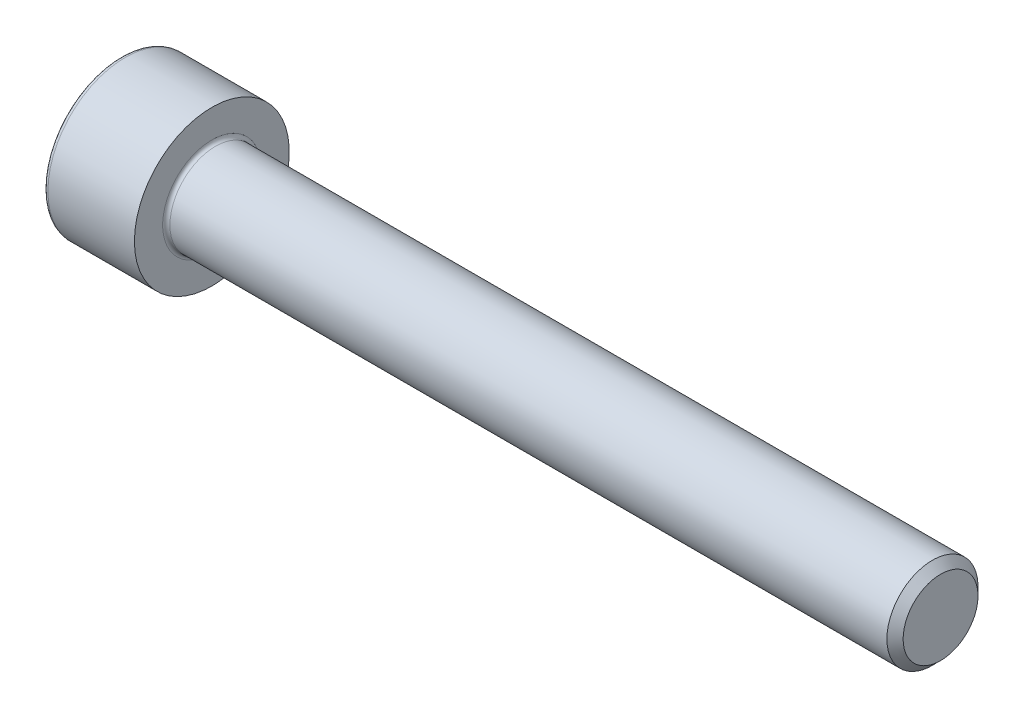
ISO-10303-21;
HEADER;
FILE_DESCRIPTION(('STEP AP214'),'2;1');
FILE_NAME('part.step','',(''),(''),'','','');
FILE_SCHEMA(('AUTOMOTIVE_DESIGN { 1 0 10303 214 1 1 1 1 }'));
ENDSEC;
DATA;
#1=APPLICATION_CONTEXT('core data for automotive mechanical design processes');
#2=APPLICATION_PROTOCOL_DEFINITION('international standard','automotive_design',2000,#1);
#3=PRODUCT_CONTEXT('',#1,'mechanical');
#4=PRODUCT('Part','Part','',(#3));
#5=PRODUCT_RELATED_PRODUCT_CATEGORY('part','',(#4));
#6=PRODUCT_DEFINITION_FORMATION('','',#4);
#7=PRODUCT_DEFINITION_CONTEXT('part definition',#1,'design');
#8=PRODUCT_DEFINITION('design','',#6,#7);
#9=PRODUCT_DEFINITION_SHAPE('','',#8);
#10=(LENGTH_UNIT() NAMED_UNIT(*) SI_UNIT(.MILLI.,.METRE.));
#11=(NAMED_UNIT(*) PLANE_ANGLE_UNIT() SI_UNIT($,.RADIAN.));
#12=(NAMED_UNIT(*) SI_UNIT($,.STERADIAN.) SOLID_ANGLE_UNIT());
#13=UNCERTAINTY_MEASURE_WITH_UNIT(LENGTH_MEASURE(1.E-05),#10,'distance_accuracy_value','');
#14=(GEOMETRIC_REPRESENTATION_CONTEXT(3) GLOBAL_UNCERTAINTY_ASSIGNED_CONTEXT((#13)) GLOBAL_UNIT_ASSIGNED_CONTEXT((#10,
#11,#12)) REPRESENTATION_CONTEXT('',''));
#15=CARTESIAN_POINT('',(0.,0.,0.));
#16=DIRECTION('',(0.,0.,1.));
#17=DIRECTION('',(1.,0.,0.));
#18=AXIS2_PLACEMENT_3D('',#15,#16,#17);
#19=CARTESIAN_POINT('',(0.,0.,0.));
#20=DIRECTION('',(-1.,0.,0.));
#21=DIRECTION('',(0.,0.,1.));
#22=AXIS2_PLACEMENT_3D('',#19,#20,#21);
#23=PLANE('',#22);
#24=DIRECTION('',(0.,-0.499999999999999,0.866025403784439));
#25=VECTOR('',#24,1.);
#26=CARTESIAN_POINT('',(0.,1.48650122786397,0.));
#27=LINE('',#26,#25);
#28=CARTESIAN_POINT('',(0.,1.48650122786397,0.));
#29=VERTEX_POINT('',#28);
#30=CARTESIAN_POINT('',(0.,0.743250613931984,1.28734782608695));
#31=VERTEX_POINT('',#30);
#32=EDGE_CURVE('E417',#29,#31,#27,.T.);
#33=ORIENTED_EDGE('',*,*,#32,.T.);
#34=DIRECTION('',(0.,1.,0.));
#35=VECTOR('',#34,1.);
#36=CARTESIAN_POINT('',(0.,-0.743250613931984,1.28734782608696));
#37=LINE('',#36,#35);
#38=CARTESIAN_POINT('',(0.,-0.743250613931984,1.28734782608696));
#39=VERTEX_POINT('',#38);
#40=EDGE_CURVE('E138',#39,#31,#37,.T.);
#41=ORIENTED_EDGE('',*,*,#40,.F.);
#42=DIRECTION('',(0.,-0.500000000000001,-0.866025403784438));
#43=VECTOR('',#42,1.);
#44=CARTESIAN_POINT('',(0.,-0.743250613931984,1.28734782608696));
#45=LINE('',#44,#43);
#46=CARTESIAN_POINT('',(0.,-1.48650122786397,0.));
#47=VERTEX_POINT('',#46);
#48=EDGE_CURVE('E422',#39,#47,#45,.T.);
#49=ORIENTED_EDGE('',*,*,#48,.T.);
#50=DIRECTION('',(0.,0.499999999999999,-0.866025403784439));
#51=VECTOR('',#50,1.);
#52=CARTESIAN_POINT('',(0.,-1.48650122786397,0.));
#53=LINE('',#52,#51);
#54=CARTESIAN_POINT('',(0.,-0.743250613931988,-1.28734782608696));
#55=VERTEX_POINT('',#54);
#56=EDGE_CURVE('E426',#47,#55,#53,.T.);
#57=ORIENTED_EDGE('',*,*,#56,.T.);
#58=DIRECTION('',(0.,-1.,0.));
#59=VECTOR('',#58,1.);
#60=CARTESIAN_POINT('',(0.,0.74325061393198,-1.28734782608696));
#61=LINE('',#60,#59);
#62=CARTESIAN_POINT('',(0.,0.74325061393198,-1.28734782608696));
#63=VERTEX_POINT('',#62);
#64=EDGE_CURVE('E430',#63,#55,#61,.T.);
#65=ORIENTED_EDGE('',*,*,#64,.F.);
#66=DIRECTION('',(0.,-0.500000000000001,-0.866025403784438));
#67=VECTOR('',#66,1.);
#68=CARTESIAN_POINT('',(0.,1.48650122786397,0.));
#69=LINE('',#68,#67);
#70=EDGE_CURVE('E133',#29,#63,#69,.T.);
#71=ORIENTED_EDGE('',*,*,#70,.F.);
#72=EDGE_LOOP('',(#33,#41,#49,#57,#65,#71));
#73=FACE_BOUND('',#72,.T.);
#74=CARTESIAN_POINT('',(0.,0.,0.));
#75=DIRECTION('',(-1.,0.,0.));
#76=DIRECTION('',(0.,0.,1.));
#77=AXIS2_PLACEMENT_3D('',#74,#75,#76);
#78=CIRCLE('',#77,2.52173913043478);
#79=CARTESIAN_POINT('',(0.,0.,2.52173913043478));
#80=VERTEX_POINT('',#79);
#81=EDGE_CURVE('E52',#80,#80,#78,.T.);
#82=ORIENTED_EDGE('',*,*,#81,.T.);
#83=EDGE_LOOP('',(#82));
#84=FACE_BOUND('',#83,.T.);
#85=ADVANCED_FACE('F43',(#73,#84),#23,.T.);
#86=CARTESIAN_POINT('',(28.3695652173913,1.29554347826087,0.));
#87=DIRECTION('',(1.,0.,0.));
#88=DIRECTION('',(0.,0.,-1.));
#89=AXIS2_PLACEMENT_3D('',#86,#87,#88);
#90=PLANE('',#89);
#91=CARTESIAN_POINT('',(28.3695652173913,0.,0.));
#92=DIRECTION('',(-1.,0.,0.));
#93=DIRECTION('',(0.,0.,1.));
#94=AXIS2_PLACEMENT_3D('',#91,#92,#93);
#95=CIRCLE('',#94,1.29554347826087);
#96=CARTESIAN_POINT('',(28.3695652173913,0.,1.29554347826087));
#97=VERTEX_POINT('',#96);
#98=EDGE_CURVE('E162',#97,#97,#95,.T.);
#99=ORIENTED_EDGE('',*,*,#98,.F.);
#100=EDGE_LOOP('',(#99));
#101=FACE_BOUND('',#100,.T.);
#102=ADVANCED_FACE('F190',(#101),#90,.T.);
#103=CARTESIAN_POINT('',(28.3695652173913,0.,0.));
#104=DIRECTION('',(-1.,0.,0.));
#105=DIRECTION('',(0.,0.,1.));
#106=AXIS2_PLACEMENT_3D('',#103,#104,#105);
#107=CONICAL_SURFACE('',#106,1.29554347826087,0.78539816339745);
#108=CARTESIAN_POINT('',(28.0890217391304,0.,0.));
#109=DIRECTION('',(-1.,0.,0.));
#110=DIRECTION('',(0.,0.,1.));
#111=AXIS2_PLACEMENT_3D('',#108,#109,#110);
#112=CIRCLE('',#111,1.57608695652174);
#113=CARTESIAN_POINT('',(28.0890217391304,0.,1.57608695652174));
#114=VERTEX_POINT('',#113);
#115=EDGE_CURVE('E158',#114,#114,#112,.T.);
#116=ORIENTED_EDGE('',*,*,#115,.F.);
#117=EDGE_LOOP('',(#116));
#118=FACE_BOUND('',#117,.T.);
#119=ORIENTED_EDGE('',*,*,#98,.T.);
#120=EDGE_LOOP('',(#119));
#121=FACE_BOUND('',#120,.T.);
#122=ADVANCED_FACE('F196',(#118,#121),#107,.T.);
#123=CARTESIAN_POINT('',(-20.0163043478261,0.,0.));
#124=DIRECTION('',(-1.,0.,0.));
#125=DIRECTION('',(0.,0.,1.));
#126=AXIS2_PLACEMENT_3D('',#123,#124,#125);
#127=CYLINDRICAL_SURFACE('',#126,1.57608695652174);
#128=CARTESIAN_POINT('',(3.27826086956522,0.,0.));
#129=DIRECTION('',(1.,0.,0.));
#130=DIRECTION('',(0.,0.,-1.));
#131=AXIS2_PLACEMENT_3D('',#128,#129,#130);
#132=CIRCLE('',#131,1.57608695652174);
#133=CARTESIAN_POINT('',(3.27826086956522,0.,-1.57608695652174));
#134=VERTEX_POINT('',#133);
#135=EDGE_CURVE('E170',#134,#134,#132,.T.);
#136=ORIENTED_EDGE('',*,*,#135,.T.);
#137=EDGE_LOOP('',(#136));
#138=FACE_BOUND('',#137,.T.);
#139=ORIENTED_EDGE('',*,*,#115,.T.);
#140=EDGE_LOOP('',(#139));
#141=FACE_BOUND('',#140,.T.);
#142=ADVANCED_FACE('F208',(#138,#141),#127,.T.);
#143=CARTESIAN_POINT('',(3.15217391304348,2.67934782608696,0.));
#144=DIRECTION('',(1.,0.,0.));
#145=DIRECTION('',(0.,0.,-1.));
#146=AXIS2_PLACEMENT_3D('',#143,#144,#145);
#147=PLANE('',#146);
#148=CARTESIAN_POINT('',(3.15217391304348,0.,0.));
#149=DIRECTION('',(1.,0.,0.));
#150=DIRECTION('',(0.,0.,-1.));
#151=AXIS2_PLACEMENT_3D('',#148,#149,#150);
#152=CIRCLE('',#151,1.70217391304348);
#153=CARTESIAN_POINT('',(3.15217391304348,0.,-1.70217391304348));
#154=VERTEX_POINT('',#153);
#155=EDGE_CURVE('E166',#154,#154,#152,.F.);
#156=ORIENTED_EDGE('',*,*,#155,.T.);
#157=EDGE_LOOP('',(#156));
#158=FACE_BOUND('',#157,.T.);
#159=CARTESIAN_POINT('',(3.15217391304348,0.,0.));
#160=DIRECTION('',(-1.,0.,0.));
#161=DIRECTION('',(0.,0.,1.));
#162=AXIS2_PLACEMENT_3D('',#159,#160,#161);
#163=CIRCLE('',#162,2.67934782608696);
#164=CARTESIAN_POINT('',(3.15217391304348,0.,2.67934782608696));
#165=VERTEX_POINT('',#164);
#166=EDGE_CURVE('E153',#165,#165,#163,.T.);
#167=ORIENTED_EDGE('',*,*,#166,.F.);
#168=EDGE_LOOP('',(#167));
#169=FACE_BOUND('',#168,.T.);
#170=ADVANCED_FACE('F204',(#158,#169),#147,.T.);
#171=CARTESIAN_POINT('',(-20.0163043478261,0.,0.));
#172=DIRECTION('',(-1.,0.,0.));
#173=DIRECTION('',(0.,0.,1.));
#174=AXIS2_PLACEMENT_3D('',#171,#172,#173);
#175=CYLINDRICAL_SURFACE('',#174,2.67934782608696);
#176=CARTESIAN_POINT('',(0.157608695652174,0.,0.));
#177=DIRECTION('',(-1.,0.,0.));
#178=DIRECTION('',(0.,0.,1.));
#179=AXIS2_PLACEMENT_3D('',#176,#177,#178);
#180=CIRCLE('',#179,2.67934782608696);
#181=CARTESIAN_POINT('',(0.157608695652174,0.,2.67934782608696));
#182=VERTEX_POINT('',#181);
#183=EDGE_CURVE('E11',#182,#182,#180,.F.);
#184=ORIENTED_EDGE('',*,*,#183,.T.);
#185=EDGE_LOOP('',(#184));
#186=FACE_BOUND('',#185,.T.);
#187=ORIENTED_EDGE('',*,*,#166,.T.);
#188=EDGE_LOOP('',(#187));
#189=FACE_BOUND('',#188,.T.);
#190=ADVANCED_FACE('F186',(#186,#189),#175,.T.);
#191=CARTESIAN_POINT('',(3.27826086956522,0.,0.));
#192=DIRECTION('',(1.,0.,0.));
#193=DIRECTION('',(0.,0.,-1.));
#194=AXIS2_PLACEMENT_3D('',#191,#192,#193);
#195=TOROIDAL_SURFACE('',#194,1.70217391304348,0.126086956521739);
#196=ORIENTED_EDGE('',*,*,#135,.F.);
#197=EDGE_LOOP('',(#196));
#198=FACE_BOUND('',#197,.T.);
#199=ORIENTED_EDGE('',*,*,#155,.F.);
#200=EDGE_LOOP('',(#199));
#201=FACE_BOUND('',#200,.T.);
#202=ADVANCED_FACE('F179',(#198,#201),#195,.F.);
#203=CARTESIAN_POINT('',(0.157608695652174,0.,0.));
#204=DIRECTION('',(-1.,0.,0.));
#205=DIRECTION('',(0.,0.,1.));
#206=AXIS2_PLACEMENT_3D('',#203,#204,#205);
#207=TOROIDAL_SURFACE('',#206,2.52173913043478,0.157608695652174);
#208=ORIENTED_EDGE('',*,*,#183,.F.);
#209=EDGE_LOOP('',(#208));
#210=FACE_BOUND('',#209,.T.);
#211=ORIENTED_EDGE('',*,*,#81,.F.);
#212=EDGE_LOOP('',(#211));
#213=FACE_BOUND('',#212,.T.);
#214=ADVANCED_FACE('F45',(#210,#213),#207,.T.);
#215=CARTESIAN_POINT('',(1.57608695652174,1.48650122786397,0.));
#216=DIRECTION('',(0.,-0.866025403784439,-0.499999999999999));
#217=DIRECTION('',(0.,0.499999999999999,-0.866025403784439));
#218=AXIS2_PLACEMENT_3D('',#215,#216,#217);
#219=PLANE('',#218);
#220=ORIENTED_EDGE('',*,*,#32,.F.);
#221=DIRECTION('',(-1.,0.,0.));
#222=VECTOR('',#221,1.);
#223=CARTESIAN_POINT('',(1.57608695652174,1.48650122786397,0.));
#224=LINE('',#223,#222);
#225=CARTESIAN_POINT('',(1.57608695652174,1.48650122786397,0.));
#226=VERTEX_POINT('',#225);
#227=EDGE_CURVE('E416',#226,#29,#224,.T.);
#228=ORIENTED_EDGE('',*,*,#227,.F.);
#229=DIRECTION('',(0.,-0.499999999999999,0.866025403784439));
#230=VECTOR('',#229,1.);
#231=CARTESIAN_POINT('',(1.57608695652174,1.48650122786397,0.));
#232=LINE('',#231,#230);
#233=CARTESIAN_POINT('',(1.57608695652174,1.11487592089798,0.643673913043477));
#234=VERTEX_POINT('',#233);
#235=EDGE_CURVE('E59',#226,#234,#232,.T.);
#236=ORIENTED_EDGE('',*,*,#235,.T.);
#237=CARTESIAN_POINT('',(1.57608695652174,0.743250613931984,1.28734782608695));
#238=VERTEX_POINT('',#237);
#239=EDGE_CURVE('E117',#234,#238,#232,.T.);
#240=ORIENTED_EDGE('',*,*,#239,.T.);
#241=DIRECTION('',(-1.,0.,0.));
#242=VECTOR('',#241,1.);
#243=CARTESIAN_POINT('',(1.57608695652174,0.743250613931984,1.28734782608695));
#244=LINE('',#243,#242);
#245=EDGE_CURVE('E130',#238,#31,#244,.T.);
#246=ORIENTED_EDGE('',*,*,#245,.T.);
#247=EDGE_LOOP('',(#220,#228,#236,#240,#246));
#248=FACE_BOUND('',#247,.T.);
#249=ADVANCED_FACE('F129',(#248),#219,.T.);
#250=CARTESIAN_POINT('',(1.57608695652174,-0.743250613931984,1.28734782608696));
#251=DIRECTION('',(0.,0.,1.));
#252=DIRECTION('',(0.,-1.,0.));
#253=AXIS2_PLACEMENT_3D('',#250,#251,#252);
#254=PLANE('',#253);
#255=ORIENTED_EDGE('',*,*,#40,.T.);
#256=ORIENTED_EDGE('',*,*,#245,.F.);
#257=DIRECTION('',(0.,1.,0.));
#258=VECTOR('',#257,1.);
#259=CARTESIAN_POINT('',(1.57608695652174,-0.743250613931984,1.28734782608696));
#260=LINE('',#259,#258);
#261=CARTESIAN_POINT('',(1.57608695652174,0.,1.28734782608695));
#262=VERTEX_POINT('',#261);
#263=EDGE_CURVE('E115',#262,#238,#260,.T.);
#264=ORIENTED_EDGE('',*,*,#263,.F.);
#265=CARTESIAN_POINT('',(1.57608695652174,-0.743250613931984,1.28734782608696));
#266=VERTEX_POINT('',#265);
#267=EDGE_CURVE('E126',#266,#262,#260,.T.);
#268=ORIENTED_EDGE('',*,*,#267,.F.);
#269=DIRECTION('',(-1.,0.,0.));
#270=VECTOR('',#269,1.);
#271=CARTESIAN_POINT('',(1.57608695652174,-0.743250613931984,1.28734782608696));
#272=LINE('',#271,#270);
#273=EDGE_CURVE('E141',#266,#39,#272,.T.);
#274=ORIENTED_EDGE('',*,*,#273,.T.);
#275=EDGE_LOOP('',(#255,#256,#264,#268,#274));
#276=FACE_BOUND('',#275,.T.);
#277=ADVANCED_FACE('F135',(#276),#254,.F.);
#278=CARTESIAN_POINT('',(1.57608695652174,-0.743250613931984,1.28734782608696));
#279=DIRECTION('',(0.,0.866025403784438,-0.500000000000001));
#280=DIRECTION('',(0.,0.500000000000001,0.866025403784438));
#281=AXIS2_PLACEMENT_3D('',#278,#279,#280);
#282=PLANE('',#281);
#283=ORIENTED_EDGE('',*,*,#48,.F.);
#284=ORIENTED_EDGE('',*,*,#273,.F.);
#285=DIRECTION('',(0.,-0.500000000000001,-0.866025403784438));
#286=VECTOR('',#285,1.);
#287=CARTESIAN_POINT('',(1.57608695652174,-0.743250613931984,1.28734782608696));
#288=LINE('',#287,#286);
#289=CARTESIAN_POINT('',(1.57608695652174,-1.11487592089798,0.64367391304348));
#290=VERTEX_POINT('',#289);
#291=EDGE_CURVE('E389',#266,#290,#288,.T.);
#292=ORIENTED_EDGE('',*,*,#291,.T.);
#293=CARTESIAN_POINT('',(1.57608695652174,-1.48650122786397,0.));
#294=VERTEX_POINT('',#293);
#295=EDGE_CURVE('E391',#290,#294,#288,.T.);
#296=ORIENTED_EDGE('',*,*,#295,.T.);
#297=DIRECTION('',(-1.,0.,0.));
#298=VECTOR('',#297,1.);
#299=CARTESIAN_POINT('',(1.57608695652174,-1.48650122786397,0.));
#300=LINE('',#299,#298);
#301=EDGE_CURVE('E148',#294,#47,#300,.T.);
#302=ORIENTED_EDGE('',*,*,#301,.T.);
#303=EDGE_LOOP('',(#283,#284,#292,#296,#302));
#304=FACE_BOUND('',#303,.T.);
#305=ADVANCED_FACE('F260',(#304),#282,.T.);
#306=CARTESIAN_POINT('',(1.57608695652174,-1.48650122786397,0.));
#307=DIRECTION('',(0.,0.866025403784439,0.499999999999999));
#308=DIRECTION('',(0.,-0.499999999999999,0.86602540378444));
#309=AXIS2_PLACEMENT_3D('',#306,#307,#308);
#310=PLANE('',#309);
#311=ORIENTED_EDGE('',*,*,#56,.F.);
#312=ORIENTED_EDGE('',*,*,#301,.F.);
#313=DIRECTION('',(0.,0.499999999999999,-0.866025403784439));
#314=VECTOR('',#313,1.);
#315=CARTESIAN_POINT('',(1.57608695652174,-1.48650122786397,0.));
#316=LINE('',#315,#314);
#317=CARTESIAN_POINT('',(1.57608695652174,-1.11487592089798,-0.643673913043478));
#318=VERTEX_POINT('',#317);
#319=EDGE_CURVE('E394',#294,#318,#316,.T.);
#320=ORIENTED_EDGE('',*,*,#319,.T.);
#321=CARTESIAN_POINT('',(1.57608695652174,-0.743250613931988,-1.28734782608696));
#322=VERTEX_POINT('',#321);
#323=EDGE_CURVE('E400',#318,#322,#316,.T.);
#324=ORIENTED_EDGE('',*,*,#323,.T.);
#325=DIRECTION('',(-1.,0.,0.));
#326=VECTOR('',#325,1.);
#327=CARTESIAN_POINT('',(1.57608695652174,-0.743250613931988,-1.28734782608696));
#328=LINE('',#327,#326);
#329=EDGE_CURVE('E443',#322,#55,#328,.T.);
#330=ORIENTED_EDGE('',*,*,#329,.T.);
#331=EDGE_LOOP('',(#311,#312,#320,#324,#330));
#332=FACE_BOUND('',#331,.T.);
#333=ADVANCED_FACE('F269',(#332),#310,.T.);
#334=CARTESIAN_POINT('',(1.57608695652174,0.74325061393198,-1.28734782608696));
#335=DIRECTION('',(0.,0.,-1.));
#336=DIRECTION('',(0.,1.,0.));
#337=AXIS2_PLACEMENT_3D('',#334,#335,#336);
#338=PLANE('',#337);
#339=ORIENTED_EDGE('',*,*,#64,.T.);
#340=ORIENTED_EDGE('',*,*,#329,.F.);
#341=DIRECTION('',(0.,-1.,0.));
#342=VECTOR('',#341,1.);
#343=CARTESIAN_POINT('',(1.57608695652174,0.74325061393198,-1.28734782608696));
#344=LINE('',#343,#342);
#345=CARTESIAN_POINT('',(1.57608695652174,0.,-1.28734782608696));
#346=VERTEX_POINT('',#345);
#347=EDGE_CURVE('E406',#346,#322,#344,.T.);
#348=ORIENTED_EDGE('',*,*,#347,.F.);
#349=CARTESIAN_POINT('',(1.57608695652174,0.74325061393198,-1.28734782608696));
#350=VERTEX_POINT('',#349);
#351=EDGE_CURVE('E407',#350,#346,#344,.T.);
#352=ORIENTED_EDGE('',*,*,#351,.F.);
#353=DIRECTION('',(-1.,0.,0.));
#354=VECTOR('',#353,1.);
#355=CARTESIAN_POINT('',(1.57608695652174,0.74325061393198,-1.28734782608696));
#356=LINE('',#355,#354);
#357=EDGE_CURVE('E439',#350,#63,#356,.T.);
#358=ORIENTED_EDGE('',*,*,#357,.T.);
#359=EDGE_LOOP('',(#339,#340,#348,#352,#358));
#360=FACE_BOUND('',#359,.T.);
#361=ADVANCED_FACE('F279',(#360),#338,.F.);
#362=CARTESIAN_POINT('',(1.57608695652174,1.48650122786397,0.));
#363=DIRECTION('',(0.,0.866025403784438,-0.500000000000001));
#364=DIRECTION('',(0.,0.500000000000001,0.866025403784438));
#365=AXIS2_PLACEMENT_3D('',#362,#363,#364);
#366=PLANE('',#365);
#367=ORIENTED_EDGE('',*,*,#70,.T.);
#368=ORIENTED_EDGE('',*,*,#357,.F.);
#369=DIRECTION('',(0.,-0.500000000000001,-0.866025403784438));
#370=VECTOR('',#369,1.);
#371=CARTESIAN_POINT('',(1.57608695652174,1.48650122786397,0.));
#372=LINE('',#371,#370);
#373=CARTESIAN_POINT('',(1.57608695652174,1.11487592089797,-0.643673913043479));
#374=VERTEX_POINT('',#373);
#375=EDGE_CURVE('E411',#374,#350,#372,.T.);
#376=ORIENTED_EDGE('',*,*,#375,.F.);
#377=EDGE_CURVE('E412',#226,#374,#372,.T.);
#378=ORIENTED_EDGE('',*,*,#377,.F.);
#379=ORIENTED_EDGE('',*,*,#227,.T.);
#380=EDGE_LOOP('',(#367,#368,#376,#378,#379));
#381=FACE_BOUND('',#380,.T.);
#382=ADVANCED_FACE('F289',(#381),#366,.F.);
#383=CARTESIAN_POINT('',(1.57608695652174,0.743250613931983,1.28734782608695));
#384=DIRECTION('',(-1.,0.,0.));
#385=DIRECTION('',(0.,0.,1.));
#386=AXIS2_PLACEMENT_3D('',#383,#384,#385);
#387=PLANE('',#386);
#388=CARTESIAN_POINT('',(1.57608695652174,0.,0.));
#389=DIRECTION('',(-1.,0.,0.));
#390=DIRECTION('',(0.,0.,1.));
#391=AXIS2_PLACEMENT_3D('',#388,#389,#390);
#392=CIRCLE('',#391,1.28734782608696);
#393=EDGE_CURVE('E140',#290,#262,#392,.T.);
#394=ORIENTED_EDGE('',*,*,#393,.F.);
#395=ORIENTED_EDGE('',*,*,#291,.F.);
#396=ORIENTED_EDGE('',*,*,#267,.T.);
#397=EDGE_LOOP('',(#394,#395,#396));
#398=FACE_BOUND('',#397,.T.);
#399=ADVANCED_FACE('F299',(#398),#387,.T.);
#400=EDGE_CURVE('E146',#318,#290,#392,.T.);
#401=ORIENTED_EDGE('',*,*,#400,.F.);
#402=ORIENTED_EDGE('',*,*,#319,.F.);
#403=ORIENTED_EDGE('',*,*,#295,.F.);
#404=EDGE_LOOP('',(#401,#402,#403));
#405=FACE_BOUND('',#404,.T.);
#406=ADVANCED_FACE('F309',(#405),#387,.T.);
#407=EDGE_CURVE('E456',#346,#318,#392,.T.);
#408=ORIENTED_EDGE('',*,*,#407,.F.);
#409=ORIENTED_EDGE('',*,*,#347,.T.);
#410=ORIENTED_EDGE('',*,*,#323,.F.);
#411=EDGE_LOOP('',(#408,#409,#410));
#412=FACE_BOUND('',#411,.T.);
#413=ADVANCED_FACE('F319',(#412),#387,.T.);
#414=EDGE_CURVE('E458',#374,#346,#392,.T.);
#415=ORIENTED_EDGE('',*,*,#414,.F.);
#416=ORIENTED_EDGE('',*,*,#375,.T.);
#417=ORIENTED_EDGE('',*,*,#351,.T.);
#418=EDGE_LOOP('',(#415,#416,#417));
#419=FACE_BOUND('',#418,.T.);
#420=ADVANCED_FACE('F328',(#419),#387,.T.);
#421=EDGE_CURVE('E154',#234,#374,#392,.T.);
#422=ORIENTED_EDGE('',*,*,#421,.F.);
#423=ORIENTED_EDGE('',*,*,#235,.F.);
#424=ORIENTED_EDGE('',*,*,#377,.T.);
#425=EDGE_LOOP('',(#422,#423,#424));
#426=FACE_BOUND('',#425,.T.);
#427=ADVANCED_FACE('F337',(#426),#387,.T.);
#428=EDGE_CURVE('E120',#262,#234,#392,.T.);
#429=ORIENTED_EDGE('',*,*,#428,.F.);
#430=ORIENTED_EDGE('',*,*,#263,.T.);
#431=ORIENTED_EDGE('',*,*,#239,.F.);
#432=EDGE_LOOP('',(#429,#430,#431));
#433=FACE_BOUND('',#432,.T.);
#434=ADVANCED_FACE('F116',(#433),#387,.T.);
#435=CARTESIAN_POINT('',(1.57608695652174,0.,0.));
#436=DIRECTION('',(-1.,0.,0.));
#437=DIRECTION('',(0.,0.,1.));
#438=AXIS2_PLACEMENT_3D('',#435,#436,#437);
#439=CONICAL_SURFACE('',#438,1.28734782608696,1.04719755119659);
#440=CARTESIAN_POINT('',(2.31933757045373,0.,0.));
#441=VERTEX_POINT('',#440);
#442=VERTEX_LOOP('',#441);
#443=FACE_BOUND('',#442,.T.);
#444=ORIENTED_EDGE('',*,*,#428,.T.);
#445=ORIENTED_EDGE('',*,*,#421,.T.);
#446=ORIENTED_EDGE('',*,*,#414,.T.);
#447=ORIENTED_EDGE('',*,*,#407,.T.);
#448=ORIENTED_EDGE('',*,*,#400,.T.);
#449=ORIENTED_EDGE('',*,*,#393,.T.);
#450=EDGE_LOOP('',(#444,#445,#446,#447,#448,#449));
#451=FACE_BOUND('',#450,.T.);
#452=ADVANCED_FACE('F201',(#443,#451),#439,.F.);
#453=CLOSED_SHELL('',(#85,#102,#122,#142,#170,#190,#202,#214,#249,#277,#305,#333,#361,#382,#399,
#406,#413,#420,#427,#434,#452));
#454=MANIFOLD_SOLID_BREP('B2',#453);
#455=ADVANCED_BREP_SHAPE_REPRESENTATION('',(#18,#454),#14);
#456=SHAPE_DEFINITION_REPRESENTATION(#9,#455);
ENDSEC;
END-ISO-10303-21;
